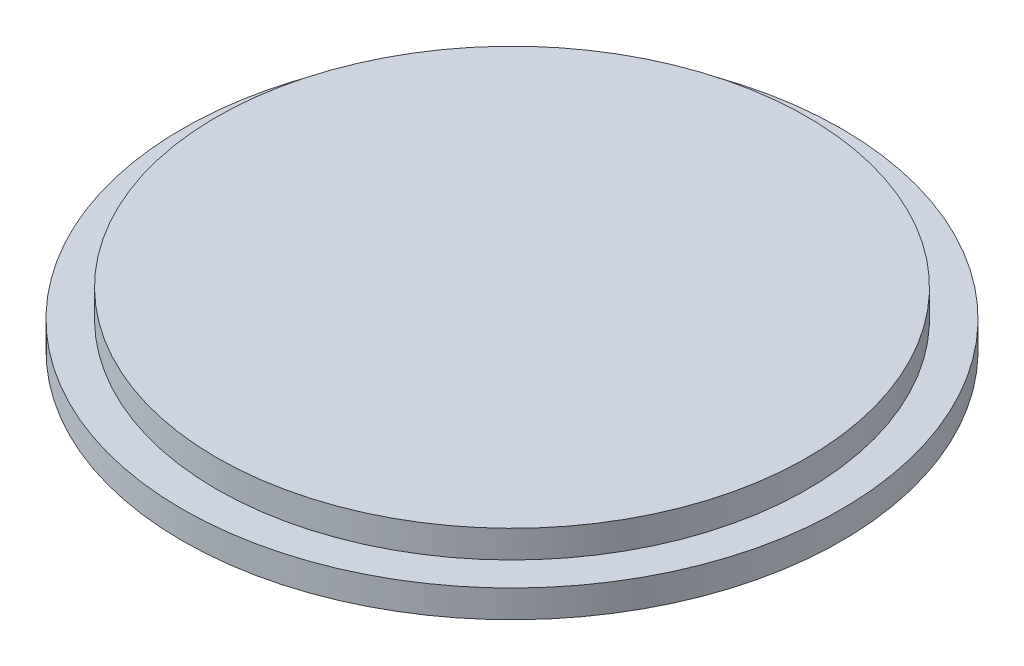
ISO-10303-21;
HEADER;
FILE_DESCRIPTION(('STEP AP214'),'2;1');
FILE_NAME('part.step','',(''),(''),'','','');
FILE_SCHEMA(('AUTOMOTIVE_DESIGN { 1 0 10303 214 1 1 1 1 }'));
ENDSEC;
DATA;
#1=APPLICATION_CONTEXT('core data for automotive mechanical design processes');
#2=APPLICATION_PROTOCOL_DEFINITION('international standard','automotive_design',2000,#1);
#3=PRODUCT_CONTEXT('',#1,'mechanical');
#4=PRODUCT('Part','Part','',(#3));
#5=PRODUCT_RELATED_PRODUCT_CATEGORY('part','',(#4));
#6=PRODUCT_DEFINITION_FORMATION('','',#4);
#7=PRODUCT_DEFINITION_CONTEXT('part definition',#1,'design');
#8=PRODUCT_DEFINITION('design','',#6,#7);
#9=PRODUCT_DEFINITION_SHAPE('','',#8);
#10=(LENGTH_UNIT() NAMED_UNIT(*) SI_UNIT(.MILLI.,.METRE.));
#11=(NAMED_UNIT(*) PLANE_ANGLE_UNIT() SI_UNIT($,.RADIAN.));
#12=(NAMED_UNIT(*) SI_UNIT($,.STERADIAN.) SOLID_ANGLE_UNIT());
#13=UNCERTAINTY_MEASURE_WITH_UNIT(LENGTH_MEASURE(1.E-05),#10,'distance_accuracy_value','');
#14=(GEOMETRIC_REPRESENTATION_CONTEXT(3) GLOBAL_UNCERTAINTY_ASSIGNED_CONTEXT((#13)) GLOBAL_UNIT_ASSIGNED_CONTEXT((#10,
#11,#12)) REPRESENTATION_CONTEXT('',''));
#15=CARTESIAN_POINT('',(0.,0.,0.));
#16=DIRECTION('',(0.,0.,1.));
#17=DIRECTION('',(1.,0.,0.));
#18=AXIS2_PLACEMENT_3D('',#15,#16,#17);
#19=CARTESIAN_POINT('',(0.,1.,0.));
#20=DIRECTION('',(0.,1.,0.));
#21=DIRECTION('',(0.,0.,1.));
#22=AXIS2_PLACEMENT_3D('',#19,#20,#21);
#23=PLANE('',#22);
#24=CARTESIAN_POINT('',(0.,1.,0.));
#25=DIRECTION('',(0.,1.,0.));
#26=DIRECTION('',(0.,0.,1.));
#27=AXIS2_PLACEMENT_3D('',#24,#25,#26);
#28=CIRCLE('',#27,12.);
#29=CARTESIAN_POINT('',(0.,1.,12.));
#30=VERTEX_POINT('',#29);
#31=EDGE_CURVE('E10',#30,#30,#28,.T.);
#32=ORIENTED_EDGE('',*,*,#31,.T.);
#33=EDGE_LOOP('',(#32));
#34=FACE_BOUND('',#33,.T.);
#35=CARTESIAN_POINT('',(0.,1.,0.));
#36=DIRECTION('',(0.,1.,0.));
#37=DIRECTION('',(0.,0.,1.));
#38=AXIS2_PLACEMENT_3D('',#35,#36,#37);
#39=CIRCLE('',#38,10.75);
#40=CARTESIAN_POINT('',(0.,1.,10.75));
#41=VERTEX_POINT('',#40);
#42=EDGE_CURVE('E52',#41,#41,#39,.T.);
#43=ORIENTED_EDGE('',*,*,#42,.F.);
#44=EDGE_LOOP('',(#43));
#45=FACE_BOUND('',#44,.T.);
#46=ADVANCED_FACE('F39',(#34,#45),#23,.T.);
#47=CARTESIAN_POINT('',(0.,0.,0.));
#48=DIRECTION('',(0.,1.,0.));
#49=DIRECTION('',(0.,0.,1.));
#50=AXIS2_PLACEMENT_3D('',#47,#48,#49);
#51=PLANE('',#50);
#52=CARTESIAN_POINT('',(0.,0.,0.));
#53=DIRECTION('',(0.,1.,0.));
#54=DIRECTION('',(0.,0.,1.));
#55=AXIS2_PLACEMENT_3D('',#52,#53,#54);
#56=CIRCLE('',#55,12.);
#57=CARTESIAN_POINT('',(0.,0.,12.));
#58=VERTEX_POINT('',#57);
#59=EDGE_CURVE('E43',#58,#58,#56,.T.);
#60=ORIENTED_EDGE('',*,*,#59,.F.);
#61=EDGE_LOOP('',(#60));
#62=FACE_BOUND('',#61,.T.);
#63=ADVANCED_FACE('F73',(#62),#51,.F.);
#64=CARTESIAN_POINT('',(0.,1.,0.));
#65=DIRECTION('',(0.,-1.,0.));
#66=DIRECTION('',(0.,0.,-1.));
#67=AXIS2_PLACEMENT_3D('',#64,#65,#66);
#68=CYLINDRICAL_SURFACE('',#67,12.);
#69=ORIENTED_EDGE('',*,*,#31,.F.);
#70=EDGE_LOOP('',(#69));
#71=FACE_BOUND('',#70,.T.);
#72=ORIENTED_EDGE('',*,*,#59,.T.);
#73=EDGE_LOOP('',(#72));
#74=FACE_BOUND('',#73,.T.);
#75=ADVANCED_FACE('F41',(#71,#74),#68,.T.);
#76=CARTESIAN_POINT('',(0.,2.,0.));
#77=DIRECTION('',(0.,-1.,0.));
#78=DIRECTION('',(0.,0.,-1.));
#79=AXIS2_PLACEMENT_3D('',#76,#77,#78);
#80=CYLINDRICAL_SURFACE('',#79,10.75);
#81=ORIENTED_EDGE('',*,*,#42,.T.);
#82=EDGE_LOOP('',(#81));
#83=FACE_BOUND('',#82,.T.);
#84=CARTESIAN_POINT('',(0.,2.,0.));
#85=DIRECTION('',(0.,1.,0.));
#86=DIRECTION('',(0.,0.,1.));
#87=AXIS2_PLACEMENT_3D('',#84,#85,#86);
#88=CIRCLE('',#87,10.75);
#89=CARTESIAN_POINT('',(0.,2.,10.75));
#90=VERTEX_POINT('',#89);
#91=EDGE_CURVE('E57',#90,#90,#88,.T.);
#92=ORIENTED_EDGE('',*,*,#91,.F.);
#93=EDGE_LOOP('',(#92));
#94=FACE_BOUND('',#93,.T.);
#95=ADVANCED_FACE('F64',(#83,#94),#80,.T.);
#96=CARTESIAN_POINT('',(0.,2.,0.));
#97=DIRECTION('',(0.,1.,0.));
#98=DIRECTION('',(0.,0.,1.));
#99=AXIS2_PLACEMENT_3D('',#96,#97,#98);
#100=PLANE('',#99);
#101=ORIENTED_EDGE('',*,*,#91,.T.);
#102=EDGE_LOOP('',(#101));
#103=FACE_BOUND('',#102,.T.);
#104=ADVANCED_FACE('F62',(#103),#100,.T.);
#105=CLOSED_SHELL('',(#46,#63,#75,#95,#104));
#106=MANIFOLD_SOLID_BREP('B2',#105);
#107=ADVANCED_BREP_SHAPE_REPRESENTATION('',(#18,#106),#14);
#108=SHAPE_DEFINITION_REPRESENTATION(#9,#107);
ENDSEC;
END-ISO-10303-21;
